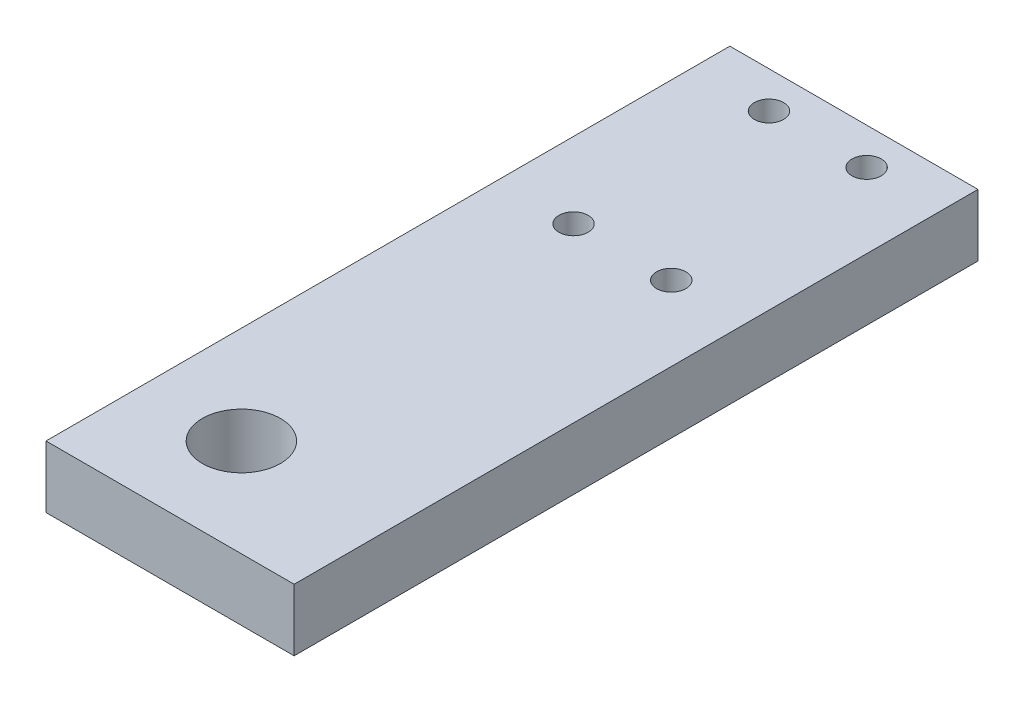
ISO-10303-21;
HEADER;
FILE_DESCRIPTION(('STEP AP214'),'2;1');
FILE_NAME('part.step','',(''),(''),'','','');
FILE_SCHEMA(('AUTOMOTIVE_DESIGN { 1 0 10303 214 1 1 1 1 }'));
ENDSEC;
DATA;
#1=APPLICATION_CONTEXT('core data for automotive mechanical design processes');
#2=APPLICATION_PROTOCOL_DEFINITION('international standard','automotive_design',2000,#1);
#3=PRODUCT_CONTEXT('',#1,'mechanical');
#4=PRODUCT('Part','Part','',(#3));
#5=PRODUCT_RELATED_PRODUCT_CATEGORY('part','',(#4));
#6=PRODUCT_DEFINITION_FORMATION('','',#4);
#7=PRODUCT_DEFINITION_CONTEXT('part definition',#1,'design');
#8=PRODUCT_DEFINITION('design','',#6,#7);
#9=PRODUCT_DEFINITION_SHAPE('','',#8);
#10=(LENGTH_UNIT() NAMED_UNIT(*) SI_UNIT(.MILLI.,.METRE.));
#11=(NAMED_UNIT(*) PLANE_ANGLE_UNIT() SI_UNIT($,.RADIAN.));
#12=(NAMED_UNIT(*) SI_UNIT($,.STERADIAN.) SOLID_ANGLE_UNIT());
#13=UNCERTAINTY_MEASURE_WITH_UNIT(LENGTH_MEASURE(1.E-05),#10,'distance_accuracy_value','');
#14=(GEOMETRIC_REPRESENTATION_CONTEXT(3) GLOBAL_UNCERTAINTY_ASSIGNED_CONTEXT((#13)) GLOBAL_UNIT_ASSIGNED_CONTEXT((#10,
#11,#12)) REPRESENTATION_CONTEXT('',''));
#15=CARTESIAN_POINT('',(0.,0.,0.));
#16=DIRECTION('',(0.,0.,1.));
#17=DIRECTION('',(1.,0.,0.));
#18=AXIS2_PLACEMENT_3D('',#15,#16,#17);
#19=CARTESIAN_POINT('',(0.,25.4,0.));
#20=DIRECTION('',(1.,0.,0.));
#21=DIRECTION('',(0.,0.,-1.));
#22=AXIS2_PLACEMENT_3D('',#19,#20,#21);
#23=PLANE('',#22);
#24=DIRECTION('',(0.,0.,1.));
#25=VECTOR('',#24,1.);
#26=CARTESIAN_POINT('',(0.,0.,0.));
#27=LINE('',#26,#25);
#28=CARTESIAN_POINT('',(0.,0.,-280.));
#29=VERTEX_POINT('',#28);
#30=CARTESIAN_POINT('',(0.,0.,0.));
#31=VERTEX_POINT('',#30);
#32=EDGE_CURVE('E94',#29,#31,#27,.T.);
#33=ORIENTED_EDGE('',*,*,#32,.T.);
#34=DIRECTION('',(0.,-1.,0.));
#35=VECTOR('',#34,1.);
#36=CARTESIAN_POINT('',(0.,25.4,0.));
#37=LINE('',#36,#35);
#38=CARTESIAN_POINT('',(0.,25.4,0.));
#39=VERTEX_POINT('',#38);
#40=EDGE_CURVE('E11',#39,#31,#37,.T.);
#41=ORIENTED_EDGE('',*,*,#40,.F.);
#42=DIRECTION('',(0.,0.,1.));
#43=VECTOR('',#42,1.);
#44=CARTESIAN_POINT('',(0.,25.4,0.));
#45=LINE('',#44,#43);
#46=CARTESIAN_POINT('',(0.,25.4,-280.));
#47=VERTEX_POINT('',#46);
#48=EDGE_CURVE('E82',#47,#39,#45,.T.);
#49=ORIENTED_EDGE('',*,*,#48,.F.);
#50=DIRECTION('',(0.,-1.,0.));
#51=VECTOR('',#50,1.);
#52=CARTESIAN_POINT('',(0.,25.4,-280.));
#53=LINE('',#52,#51);
#54=EDGE_CURVE('E90',#47,#29,#53,.T.);
#55=ORIENTED_EDGE('',*,*,#54,.T.);
#56=EDGE_LOOP('',(#33,#41,#49,#55));
#57=FACE_BOUND('',#56,.T.);
#58=ADVANCED_FACE('F31',(#57),#23,.F.);
#59=CARTESIAN_POINT('',(0.,25.4,0.));
#60=DIRECTION('',(0.,0.,-1.));
#61=DIRECTION('',(-1.,0.,0.));
#62=AXIS2_PLACEMENT_3D('',#59,#60,#61);
#63=PLANE('',#62);
#64=DIRECTION('',(1.,0.,0.));
#65=VECTOR('',#64,1.);
#66=CARTESIAN_POINT('',(0.,0.,0.));
#67=LINE('',#66,#65);
#68=CARTESIAN_POINT('',(101.6,0.,0.));
#69=VERTEX_POINT('',#68);
#70=EDGE_CURVE('E86',#31,#69,#67,.T.);
#71=ORIENTED_EDGE('',*,*,#70,.T.);
#72=DIRECTION('',(0.,-1.,0.));
#73=VECTOR('',#72,1.);
#74=CARTESIAN_POINT('',(101.6,25.4,0.));
#75=LINE('',#74,#73);
#76=CARTESIAN_POINT('',(101.6,25.4,0.));
#77=VERTEX_POINT('',#76);
#78=EDGE_CURVE('E39',#77,#69,#75,.T.);
#79=ORIENTED_EDGE('',*,*,#78,.F.);
#80=DIRECTION('',(1.,0.,0.));
#81=VECTOR('',#80,1.);
#82=CARTESIAN_POINT('',(0.,25.4,0.));
#83=LINE('',#82,#81);
#84=EDGE_CURVE('E77',#39,#77,#83,.T.);
#85=ORIENTED_EDGE('',*,*,#84,.F.);
#86=ORIENTED_EDGE('',*,*,#40,.T.);
#87=EDGE_LOOP('',(#71,#79,#85,#86));
#88=FACE_BOUND('',#87,.T.);
#89=ADVANCED_FACE('F85',(#88),#63,.F.);
#90=CARTESIAN_POINT('',(101.6,25.4,0.));
#91=DIRECTION('',(-1.,0.,0.));
#92=DIRECTION('',(0.,0.,1.));
#93=AXIS2_PLACEMENT_3D('',#90,#91,#92);
#94=PLANE('',#93);
#95=DIRECTION('',(0.,0.,-1.));
#96=VECTOR('',#95,1.);
#97=CARTESIAN_POINT('',(101.6,0.,0.));
#98=LINE('',#97,#96);
#99=CARTESIAN_POINT('',(101.6,0.,-280.));
#100=VERTEX_POINT('',#99);
#101=EDGE_CURVE('E64',#69,#100,#98,.T.);
#102=ORIENTED_EDGE('',*,*,#101,.T.);
#103=DIRECTION('',(0.,-1.,0.));
#104=VECTOR('',#103,1.);
#105=CARTESIAN_POINT('',(101.6,25.4,-280.));
#106=LINE('',#105,#104);
#107=CARTESIAN_POINT('',(101.6,25.4,-280.));
#108=VERTEX_POINT('',#107);
#109=EDGE_CURVE('E87',#108,#100,#106,.T.);
#110=ORIENTED_EDGE('',*,*,#109,.F.);
#111=DIRECTION('',(0.,0.,-1.));
#112=VECTOR('',#111,1.);
#113=CARTESIAN_POINT('',(101.6,25.4,0.));
#114=LINE('',#113,#112);
#115=EDGE_CURVE('E80',#77,#108,#114,.T.);
#116=ORIENTED_EDGE('',*,*,#115,.F.);
#117=ORIENTED_EDGE('',*,*,#78,.T.);
#118=EDGE_LOOP('',(#102,#110,#116,#117));
#119=FACE_BOUND('',#118,.T.);
#120=ADVANCED_FACE('F88',(#119),#94,.F.);
#121=CARTESIAN_POINT('',(0.,25.4,-280.));
#122=DIRECTION('',(0.,0.,1.));
#123=DIRECTION('',(1.,0.,0.));
#124=AXIS2_PLACEMENT_3D('',#121,#122,#123);
#125=PLANE('',#124);
#126=DIRECTION('',(-1.,0.,0.));
#127=VECTOR('',#126,1.);
#128=CARTESIAN_POINT('',(0.,0.,-280.));
#129=LINE('',#128,#127);
#130=EDGE_CURVE('E70',#100,#29,#129,.T.);
#131=ORIENTED_EDGE('',*,*,#130,.T.);
#132=ORIENTED_EDGE('',*,*,#54,.F.);
#133=DIRECTION('',(-1.,0.,0.));
#134=VECTOR('',#133,1.);
#135=CARTESIAN_POINT('',(0.,25.4,-280.));
#136=LINE('',#135,#134);
#137=EDGE_CURVE('E47',#108,#47,#136,.T.);
#138=ORIENTED_EDGE('',*,*,#137,.F.);
#139=ORIENTED_EDGE('',*,*,#109,.T.);
#140=EDGE_LOOP('',(#131,#132,#138,#139));
#141=FACE_BOUND('',#140,.T.);
#142=ADVANCED_FACE('F102',(#141),#125,.F.);
#143=CARTESIAN_POINT('',(0.,25.4,-280.));
#144=DIRECTION('',(0.,-1.,0.));
#145=DIRECTION('',(0.,0.,-1.));
#146=AXIS2_PLACEMENT_3D('',#143,#144,#145);
#147=PLANE('',#146);
#148=CARTESIAN_POINT('',(40.,25.4,-40.));
#149=DIRECTION('',(0.,1.,0.));
#150=DIRECTION('',(0.,0.,1.));
#151=AXIS2_PLACEMENT_3D('',#148,#149,#150);
#152=CIRCLE('',#151,16.);
#153=CARTESIAN_POINT('',(40.,25.4,-24.));
#154=VERTEX_POINT('',#153);
#155=EDGE_CURVE('E132',#154,#154,#152,.T.);
#156=ORIENTED_EDGE('',*,*,#155,.F.);
#157=EDGE_LOOP('',(#156));
#158=FACE_BOUND('',#157,.T.);
#159=CARTESIAN_POINT('',(31.,25.4,-185.));
#160=DIRECTION('',(0.,1.,0.));
#161=DIRECTION('',(0.,0.,1.));
#162=AXIS2_PLACEMENT_3D('',#159,#160,#161);
#163=CIRCLE('',#162,6.00000000000001);
#164=CARTESIAN_POINT('',(31.,25.4,-179.));
#165=VERTEX_POINT('',#164);
#166=EDGE_CURVE('E123',#165,#165,#163,.T.);
#167=ORIENTED_EDGE('',*,*,#166,.F.);
#168=EDGE_LOOP('',(#167));
#169=FACE_BOUND('',#168,.T.);
#170=CARTESIAN_POINT('',(71.,25.4,-185.));
#171=DIRECTION('',(0.,1.,0.));
#172=DIRECTION('',(0.,0.,1.));
#173=AXIS2_PLACEMENT_3D('',#170,#171,#172);
#174=CIRCLE('',#173,6.);
#175=CARTESIAN_POINT('',(71.,25.4,-179.));
#176=VERTEX_POINT('',#175);
#177=EDGE_CURVE('E117',#176,#176,#174,.T.);
#178=ORIENTED_EDGE('',*,*,#177,.F.);
#179=EDGE_LOOP('',(#178));
#180=FACE_BOUND('',#179,.T.);
#181=CARTESIAN_POINT('',(71.,25.4,-265.));
#182=DIRECTION('',(0.,1.,0.));
#183=DIRECTION('',(0.,0.,1.));
#184=AXIS2_PLACEMENT_3D('',#181,#182,#183);
#185=CIRCLE('',#184,6.);
#186=CARTESIAN_POINT('',(71.,25.4,-259.));
#187=VERTEX_POINT('',#186);
#188=EDGE_CURVE('E111',#187,#187,#185,.T.);
#189=ORIENTED_EDGE('',*,*,#188,.F.);
#190=EDGE_LOOP('',(#189));
#191=FACE_BOUND('',#190,.T.);
#192=CARTESIAN_POINT('',(31.,25.4,-265.));
#193=DIRECTION('',(0.,1.,0.));
#194=DIRECTION('',(0.,0.,1.));
#195=AXIS2_PLACEMENT_3D('',#192,#193,#194);
#196=CIRCLE('',#195,6.00000000000001);
#197=CARTESIAN_POINT('',(31.,25.4,-259.));
#198=VERTEX_POINT('',#197);
#199=EDGE_CURVE('E108',#198,#198,#196,.T.);
#200=ORIENTED_EDGE('',*,*,#199,.F.);
#201=EDGE_LOOP('',(#200));
#202=FACE_BOUND('',#201,.T.);
#203=ORIENTED_EDGE('',*,*,#48,.T.);
#204=ORIENTED_EDGE('',*,*,#84,.T.);
#205=ORIENTED_EDGE('',*,*,#115,.T.);
#206=ORIENTED_EDGE('',*,*,#137,.T.);
#207=EDGE_LOOP('',(#203,#204,#205,#206));
#208=FACE_BOUND('',#207,.T.);
#209=ADVANCED_FACE('F78',(#158,#169,#180,#191,#202,#208),#147,.F.);
#210=CARTESIAN_POINT('',(0.,0.,-280.));
#211=DIRECTION('',(0.,-1.,0.));
#212=DIRECTION('',(0.,0.,-1.));
#213=AXIS2_PLACEMENT_3D('',#210,#211,#212);
#214=PLANE('',#213);
#215=CARTESIAN_POINT('',(40.,0.,-40.));
#216=DIRECTION('',(0.,1.,0.));
#217=DIRECTION('',(0.,0.,1.));
#218=AXIS2_PLACEMENT_3D('',#215,#216,#217);
#219=CIRCLE('',#218,16.);
#220=CARTESIAN_POINT('',(40.,0.,-24.));
#221=VERTEX_POINT('',#220);
#222=EDGE_CURVE('E129',#221,#221,#219,.T.);
#223=ORIENTED_EDGE('',*,*,#222,.T.);
#224=EDGE_LOOP('',(#223));
#225=FACE_BOUND('',#224,.T.);
#226=CARTESIAN_POINT('',(31.,0.,-185.));
#227=DIRECTION('',(0.,1.,0.));
#228=DIRECTION('',(0.,0.,1.));
#229=AXIS2_PLACEMENT_3D('',#226,#227,#228);
#230=CIRCLE('',#229,6.00000000000001);
#231=CARTESIAN_POINT('',(31.,0.,-179.));
#232=VERTEX_POINT('',#231);
#233=EDGE_CURVE('E126',#232,#232,#230,.T.);
#234=ORIENTED_EDGE('',*,*,#233,.T.);
#235=EDGE_LOOP('',(#234));
#236=FACE_BOUND('',#235,.T.);
#237=CARTESIAN_POINT('',(71.,0.,-185.));
#238=DIRECTION('',(0.,1.,0.));
#239=DIRECTION('',(0.,0.,1.));
#240=AXIS2_PLACEMENT_3D('',#237,#238,#239);
#241=CIRCLE('',#240,6.);
#242=CARTESIAN_POINT('',(71.,0.,-179.));
#243=VERTEX_POINT('',#242);
#244=EDGE_CURVE('E120',#243,#243,#241,.T.);
#245=ORIENTED_EDGE('',*,*,#244,.T.);
#246=EDGE_LOOP('',(#245));
#247=FACE_BOUND('',#246,.T.);
#248=CARTESIAN_POINT('',(71.,0.,-265.));
#249=DIRECTION('',(0.,1.,0.));
#250=DIRECTION('',(0.,0.,1.));
#251=AXIS2_PLACEMENT_3D('',#248,#249,#250);
#252=CIRCLE('',#251,6.);
#253=CARTESIAN_POINT('',(71.,0.,-259.));
#254=VERTEX_POINT('',#253);
#255=EDGE_CURVE('E114',#254,#254,#252,.T.);
#256=ORIENTED_EDGE('',*,*,#255,.T.);
#257=EDGE_LOOP('',(#256));
#258=FACE_BOUND('',#257,.T.);
#259=CARTESIAN_POINT('',(31.,0.,-265.));
#260=DIRECTION('',(0.,1.,0.));
#261=DIRECTION('',(0.,0.,1.));
#262=AXIS2_PLACEMENT_3D('',#259,#260,#261);
#263=CIRCLE('',#262,6.00000000000001);
#264=CARTESIAN_POINT('',(31.,0.,-259.));
#265=VERTEX_POINT('',#264);
#266=EDGE_CURVE('E97',#265,#265,#263,.T.);
#267=ORIENTED_EDGE('',*,*,#266,.T.);
#268=EDGE_LOOP('',(#267));
#269=FACE_BOUND('',#268,.T.);
#270=ORIENTED_EDGE('',*,*,#32,.F.);
#271=ORIENTED_EDGE('',*,*,#130,.F.);
#272=ORIENTED_EDGE('',*,*,#101,.F.);
#273=ORIENTED_EDGE('',*,*,#70,.F.);
#274=EDGE_LOOP('',(#270,#271,#272,#273));
#275=FACE_BOUND('',#274,.T.);
#276=ADVANCED_FACE('F105',(#225,#236,#247,#258,#269,#275),#214,.T.);
#277=CARTESIAN_POINT('',(31.,0.,-265.));
#278=DIRECTION('',(0.,1.,0.));
#279=DIRECTION('',(0.,0.,1.));
#280=AXIS2_PLACEMENT_3D('',#277,#278,#279);
#281=CYLINDRICAL_SURFACE('',#280,6.00000000000001);
#282=ORIENTED_EDGE('',*,*,#266,.F.);
#283=EDGE_LOOP('',(#282));
#284=FACE_BOUND('',#283,.T.);
#285=ORIENTED_EDGE('',*,*,#199,.T.);
#286=EDGE_LOOP('',(#285));
#287=FACE_BOUND('',#286,.T.);
#288=ADVANCED_FACE('F158',(#284,#287),#281,.F.);
#289=CARTESIAN_POINT('',(71.,0.,-265.));
#290=DIRECTION('',(0.,1.,0.));
#291=DIRECTION('',(0.,0.,1.));
#292=AXIS2_PLACEMENT_3D('',#289,#290,#291);
#293=CYLINDRICAL_SURFACE('',#292,6.);
#294=ORIENTED_EDGE('',*,*,#255,.F.);
#295=EDGE_LOOP('',(#294));
#296=FACE_BOUND('',#295,.T.);
#297=ORIENTED_EDGE('',*,*,#188,.T.);
#298=EDGE_LOOP('',(#297));
#299=FACE_BOUND('',#298,.T.);
#300=ADVANCED_FACE('F160',(#296,#299),#293,.F.);
#301=CARTESIAN_POINT('',(71.,0.,-185.));
#302=DIRECTION('',(0.,1.,0.));
#303=DIRECTION('',(0.,0.,1.));
#304=AXIS2_PLACEMENT_3D('',#301,#302,#303);
#305=CYLINDRICAL_SURFACE('',#304,6.);
#306=ORIENTED_EDGE('',*,*,#244,.F.);
#307=EDGE_LOOP('',(#306));
#308=FACE_BOUND('',#307,.T.);
#309=ORIENTED_EDGE('',*,*,#177,.T.);
#310=EDGE_LOOP('',(#309));
#311=FACE_BOUND('',#310,.T.);
#312=ADVANCED_FACE('F167',(#308,#311),#305,.F.);
#313=CARTESIAN_POINT('',(31.,0.,-185.));
#314=DIRECTION('',(0.,1.,0.));
#315=DIRECTION('',(0.,0.,1.));
#316=AXIS2_PLACEMENT_3D('',#313,#314,#315);
#317=CYLINDRICAL_SURFACE('',#316,6.00000000000001);
#318=ORIENTED_EDGE('',*,*,#233,.F.);
#319=EDGE_LOOP('',(#318));
#320=FACE_BOUND('',#319,.T.);
#321=ORIENTED_EDGE('',*,*,#166,.T.);
#322=EDGE_LOOP('',(#321));
#323=FACE_BOUND('',#322,.T.);
#324=ADVANCED_FACE('F143',(#320,#323),#317,.F.);
#325=CARTESIAN_POINT('',(40.,0.,-40.));
#326=DIRECTION('',(0.,1.,0.));
#327=DIRECTION('',(0.,0.,1.));
#328=AXIS2_PLACEMENT_3D('',#325,#326,#327);
#329=CYLINDRICAL_SURFACE('',#328,16.);
#330=ORIENTED_EDGE('',*,*,#222,.F.);
#331=EDGE_LOOP('',(#330));
#332=FACE_BOUND('',#331,.T.);
#333=ORIENTED_EDGE('',*,*,#155,.T.);
#334=EDGE_LOOP('',(#333));
#335=FACE_BOUND('',#334,.T.);
#336=ADVANCED_FACE('F140',(#332,#335),#329,.F.);
#337=CLOSED_SHELL('',(#58,#89,#120,#142,#209,#276,#288,#300,#312,#324,#336));
#338=MANIFOLD_SOLID_BREP('B2',#337);
#339=ADVANCED_BREP_SHAPE_REPRESENTATION('',(#18,#338),#14);
#340=SHAPE_DEFINITION_REPRESENTATION(#9,#339);
ENDSEC;
END-ISO-10303-21;
